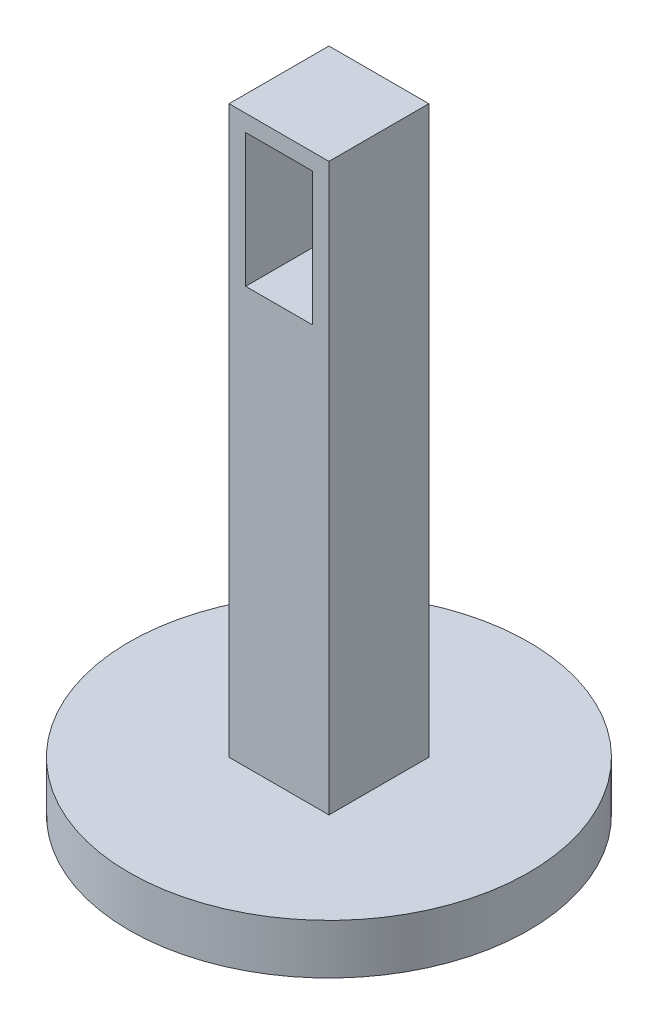
ISO-10303-21;
HEADER;
FILE_DESCRIPTION(('STEP AP214'),'2;1');
FILE_NAME('part.step','',(''),(''),'','','');
FILE_SCHEMA(('AUTOMOTIVE_DESIGN { 1 0 10303 214 1 1 1 1 }'));
ENDSEC;
DATA;
#1=APPLICATION_CONTEXT('core data for automotive mechanical design processes');
#2=APPLICATION_PROTOCOL_DEFINITION('international standard','automotive_design',2000,#1);
#3=PRODUCT_CONTEXT('',#1,'mechanical');
#4=PRODUCT('Part','Part','',(#3));
#5=PRODUCT_RELATED_PRODUCT_CATEGORY('part','',(#4));
#6=PRODUCT_DEFINITION_FORMATION('','',#4);
#7=PRODUCT_DEFINITION_CONTEXT('part definition',#1,'design');
#8=PRODUCT_DEFINITION('design','',#6,#7);
#9=PRODUCT_DEFINITION_SHAPE('','',#8);
#10=(LENGTH_UNIT() NAMED_UNIT(*) SI_UNIT(.MILLI.,.METRE.));
#11=(NAMED_UNIT(*) PLANE_ANGLE_UNIT() SI_UNIT($,.RADIAN.));
#12=(NAMED_UNIT(*) SI_UNIT($,.STERADIAN.) SOLID_ANGLE_UNIT());
#13=UNCERTAINTY_MEASURE_WITH_UNIT(LENGTH_MEASURE(1.E-05),#10,'distance_accuracy_value','');
#14=(GEOMETRIC_REPRESENTATION_CONTEXT(3) GLOBAL_UNCERTAINTY_ASSIGNED_CONTEXT((#13)) GLOBAL_UNIT_ASSIGNED_CONTEXT((#10,
#11,#12)) REPRESENTATION_CONTEXT('',''));
#15=CARTESIAN_POINT('',(0.,0.,0.));
#16=DIRECTION('',(0.,0.,1.));
#17=DIRECTION('',(1.,0.,0.));
#18=AXIS2_PLACEMENT_3D('',#15,#16,#17);
#19=CARTESIAN_POINT('',(0.,15.,0.));
#20=DIRECTION('',(0.,-1.,0.));
#21=DIRECTION('',(0.,0.,-1.));
#22=AXIS2_PLACEMENT_3D('',#19,#20,#21);
#23=CYLINDRICAL_SURFACE('',#22,60.);
#24=CARTESIAN_POINT('',(0.,15.,0.));
#25=DIRECTION('',(0.,1.,0.));
#26=DIRECTION('',(0.,0.,1.));
#27=AXIS2_PLACEMENT_3D('',#24,#25,#26);
#28=CIRCLE('',#27,60.);
#29=CARTESIAN_POINT('',(0.,15.,60.));
#30=VERTEX_POINT('',#29);
#31=EDGE_CURVE('E11',#30,#30,#28,.T.);
#32=ORIENTED_EDGE('',*,*,#31,.F.);
#33=EDGE_LOOP('',(#32));
#34=FACE_BOUND('',#33,.T.);
#35=CARTESIAN_POINT('',(0.,0.,0.));
#36=DIRECTION('',(0.,1.,0.));
#37=DIRECTION('',(0.,0.,1.));
#38=AXIS2_PLACEMENT_3D('',#35,#36,#37);
#39=CIRCLE('',#38,60.);
#40=CARTESIAN_POINT('',(0.,0.,60.));
#41=VERTEX_POINT('',#40);
#42=EDGE_CURVE('E42',#41,#41,#39,.T.);
#43=ORIENTED_EDGE('',*,*,#42,.T.);
#44=EDGE_LOOP('',(#43));
#45=FACE_BOUND('',#44,.T.);
#46=ADVANCED_FACE('F39',(#34,#45),#23,.T.);
#47=CARTESIAN_POINT('',(0.,15.,0.));
#48=DIRECTION('',(0.,1.,0.));
#49=DIRECTION('',(0.,0.,1.));
#50=AXIS2_PLACEMENT_3D('',#47,#48,#49);
#51=PLANE('',#50);
#52=DIRECTION('',(0.,0.,-1.));
#53=VECTOR('',#52,1.);
#54=CARTESIAN_POINT('',(15.,15.,-15.));
#55=LINE('',#54,#53);
#56=CARTESIAN_POINT('',(15.,15.,15.));
#57=VERTEX_POINT('',#56);
#58=CARTESIAN_POINT('',(15.,15.,-15.));
#59=VERTEX_POINT('',#58);
#60=EDGE_CURVE('E62',#57,#59,#55,.T.);
#61=ORIENTED_EDGE('',*,*,#60,.F.);
#62=DIRECTION('',(1.,0.,0.));
#63=VECTOR('',#62,1.);
#64=CARTESIAN_POINT('',(-15.,15.,15.));
#65=LINE('',#64,#63);
#66=CARTESIAN_POINT('',(-15.,15.,15.));
#67=VERTEX_POINT('',#66);
#68=EDGE_CURVE('E158',#67,#57,#65,.T.);
#69=ORIENTED_EDGE('',*,*,#68,.F.);
#70=DIRECTION('',(0.,0.,1.));
#71=VECTOR('',#70,1.);
#72=CARTESIAN_POINT('',(-15.,15.,-15.));
#73=LINE('',#72,#71);
#74=CARTESIAN_POINT('',(-15.,15.,-15.));
#75=VERTEX_POINT('',#74);
#76=EDGE_CURVE('E174',#75,#67,#73,.T.);
#77=ORIENTED_EDGE('',*,*,#76,.F.);
#78=DIRECTION('',(-1.,0.,0.));
#79=VECTOR('',#78,1.);
#80=CARTESIAN_POINT('',(-15.,15.,-15.));
#81=LINE('',#80,#79);
#82=EDGE_CURVE('E170',#59,#75,#81,.T.);
#83=ORIENTED_EDGE('',*,*,#82,.F.);
#84=EDGE_LOOP('',(#61,#69,#77,#83));
#85=FACE_BOUND('',#84,.T.);
#86=ORIENTED_EDGE('',*,*,#31,.T.);
#87=EDGE_LOOP('',(#86));
#88=FACE_BOUND('',#87,.T.);
#89=ADVANCED_FACE('F204',(#85,#88),#51,.T.);
#90=CARTESIAN_POINT('',(0.,0.,0.));
#91=DIRECTION('',(0.,1.,0.));
#92=DIRECTION('',(0.,0.,1.));
#93=AXIS2_PLACEMENT_3D('',#90,#91,#92);
#94=PLANE('',#93);
#95=ORIENTED_EDGE('',*,*,#42,.F.);
#96=EDGE_LOOP('',(#95));
#97=FACE_BOUND('',#96,.T.);
#98=ADVANCED_FACE('F201',(#97),#94,.F.);
#99=CARTESIAN_POINT('',(15.,185.,-15.));
#100=DIRECTION('',(-1.,0.,0.));
#101=DIRECTION('',(0.,0.,1.));
#102=AXIS2_PLACEMENT_3D('',#99,#100,#101);
#103=PLANE('',#102);
#104=ORIENTED_EDGE('',*,*,#60,.T.);
#105=DIRECTION('',(0.,-1.,0.));
#106=VECTOR('',#105,1.);
#107=CARTESIAN_POINT('',(15.,185.,-15.));
#108=LINE('',#107,#106);
#109=CARTESIAN_POINT('',(15.,185.,-15.));
#110=VERTEX_POINT('',#109);
#111=EDGE_CURVE('E191',#110,#59,#108,.T.);
#112=ORIENTED_EDGE('',*,*,#111,.F.);
#113=DIRECTION('',(0.,0.,-1.));
#114=VECTOR('',#113,1.);
#115=CARTESIAN_POINT('',(15.,185.,-15.));
#116=LINE('',#115,#114);
#117=CARTESIAN_POINT('',(15.,185.,15.));
#118=VERTEX_POINT('',#117);
#119=EDGE_CURVE('E153',#118,#110,#116,.T.);
#120=ORIENTED_EDGE('',*,*,#119,.F.);
#121=DIRECTION('',(0.,-1.,0.));
#122=VECTOR('',#121,1.);
#123=CARTESIAN_POINT('',(15.,185.,15.));
#124=LINE('',#123,#122);
#125=EDGE_CURVE('E167',#118,#57,#124,.T.);
#126=ORIENTED_EDGE('',*,*,#125,.T.);
#127=EDGE_LOOP('',(#104,#112,#120,#126));
#128=FACE_BOUND('',#127,.T.);
#129=ADVANCED_FACE('F203',(#128),#103,.F.);
#130=CARTESIAN_POINT('',(-15.,185.,-15.));
#131=DIRECTION('',(0.,0.,1.));
#132=DIRECTION('',(1.,0.,0.));
#133=AXIS2_PLACEMENT_3D('',#130,#131,#132);
#134=PLANE('',#133);
#135=ORIENTED_EDGE('',*,*,#82,.T.);
#136=DIRECTION('',(0.,-1.,0.));
#137=VECTOR('',#136,1.);
#138=CARTESIAN_POINT('',(-15.,185.,-15.));
#139=LINE('',#138,#137);
#140=CARTESIAN_POINT('',(-15.,185.,-15.));
#141=VERTEX_POINT('',#140);
#142=EDGE_CURVE('E187',#141,#75,#139,.T.);
#143=ORIENTED_EDGE('',*,*,#142,.F.);
#144=DIRECTION('',(-1.,0.,0.));
#145=VECTOR('',#144,1.);
#146=CARTESIAN_POINT('',(-15.,185.,-15.));
#147=LINE('',#146,#145);
#148=EDGE_CURVE('E157',#110,#141,#147,.T.);
#149=ORIENTED_EDGE('',*,*,#148,.F.);
#150=ORIENTED_EDGE('',*,*,#111,.T.);
#151=EDGE_LOOP('',(#135,#143,#149,#150));
#152=FACE_BOUND('',#151,.T.);
#153=ADVANCED_FACE('F209',(#152),#134,.F.);
#154=CARTESIAN_POINT('',(-15.,185.,-15.));
#155=DIRECTION('',(1.,0.,0.));
#156=DIRECTION('',(0.,0.,-1.));
#157=AXIS2_PLACEMENT_3D('',#154,#155,#156);
#158=PLANE('',#157);
#159=ORIENTED_EDGE('',*,*,#76,.T.);
#160=DIRECTION('',(0.,-1.,0.));
#161=VECTOR('',#160,1.);
#162=CARTESIAN_POINT('',(-15.,185.,15.));
#163=LINE('',#162,#161);
#164=CARTESIAN_POINT('',(-15.,185.,15.));
#165=VERTEX_POINT('',#164);
#166=EDGE_CURVE('E183',#165,#67,#163,.T.);
#167=ORIENTED_EDGE('',*,*,#166,.F.);
#168=DIRECTION('',(0.,0.,1.));
#169=VECTOR('',#168,1.);
#170=CARTESIAN_POINT('',(-15.,185.,-15.));
#171=LINE('',#170,#169);
#172=EDGE_CURVE('E161',#141,#165,#171,.T.);
#173=ORIENTED_EDGE('',*,*,#172,.F.);
#174=ORIENTED_EDGE('',*,*,#142,.T.);
#175=EDGE_LOOP('',(#159,#167,#173,#174));
#176=FACE_BOUND('',#175,.T.);
#177=ADVANCED_FACE('F240',(#176),#158,.F.);
#178=CARTESIAN_POINT('',(-15.,185.,15.));
#179=DIRECTION('',(0.,0.,-1.));
#180=DIRECTION('',(-1.,0.,0.));
#181=AXIS2_PLACEMENT_3D('',#178,#179,#180);
#182=PLANE('',#181);
#183=DIRECTION('',(1.,0.,0.));
#184=VECTOR('',#183,1.);
#185=CARTESIAN_POINT('',(-10.,140.,15.));
#186=LINE('',#185,#184);
#187=CARTESIAN_POINT('',(-10.,140.,15.));
#188=VERTEX_POINT('',#187);
#189=CARTESIAN_POINT('',(10.,140.,15.));
#190=VERTEX_POINT('',#189);
#191=EDGE_CURVE('E139',#188,#190,#186,.T.);
#192=ORIENTED_EDGE('',*,*,#191,.F.);
#193=DIRECTION('',(0.,-1.,0.));
#194=VECTOR('',#193,1.);
#195=CARTESIAN_POINT('',(-10.,180.,15.));
#196=LINE('',#195,#194);
#197=CARTESIAN_POINT('',(-10.,180.,15.));
#198=VERTEX_POINT('',#197);
#199=EDGE_CURVE('E54',#198,#188,#196,.T.);
#200=ORIENTED_EDGE('',*,*,#199,.F.);
#201=DIRECTION('',(1.,0.,0.));
#202=VECTOR('',#201,1.);
#203=CARTESIAN_POINT('',(-10.,180.,15.));
#204=LINE('',#203,#202);
#205=CARTESIAN_POINT('',(10.,180.,15.));
#206=VERTEX_POINT('',#205);
#207=EDGE_CURVE('E126',#198,#206,#204,.T.);
#208=ORIENTED_EDGE('',*,*,#207,.T.);
#209=DIRECTION('',(0.,-1.,0.));
#210=VECTOR('',#209,1.);
#211=CARTESIAN_POINT('',(10.,180.,15.));
#212=LINE('',#211,#210);
#213=EDGE_CURVE('E130',#206,#190,#212,.T.);
#214=ORIENTED_EDGE('',*,*,#213,.T.);
#215=EDGE_LOOP('',(#192,#200,#208,#214));
#216=FACE_BOUND('',#215,.T.);
#217=ORIENTED_EDGE('',*,*,#68,.T.);
#218=ORIENTED_EDGE('',*,*,#125,.F.);
#219=DIRECTION('',(1.,0.,0.));
#220=VECTOR('',#219,1.);
#221=CARTESIAN_POINT('',(-15.,185.,15.));
#222=LINE('',#221,#220);
#223=EDGE_CURVE('E164',#165,#118,#222,.T.);
#224=ORIENTED_EDGE('',*,*,#223,.F.);
#225=ORIENTED_EDGE('',*,*,#166,.T.);
#226=EDGE_LOOP('',(#217,#218,#224,#225));
#227=FACE_BOUND('',#226,.T.);
#228=ADVANCED_FACE('F249',(#216,#227),#182,.F.);
#229=CARTESIAN_POINT('',(0.,185.,0.));
#230=DIRECTION('',(0.,1.,0.));
#231=DIRECTION('',(0.,0.,1.));
#232=AXIS2_PLACEMENT_3D('',#229,#230,#231);
#233=PLANE('',#232);
#234=ORIENTED_EDGE('',*,*,#119,.T.);
#235=ORIENTED_EDGE('',*,*,#148,.T.);
#236=ORIENTED_EDGE('',*,*,#172,.T.);
#237=ORIENTED_EDGE('',*,*,#223,.T.);
#238=EDGE_LOOP('',(#234,#235,#236,#237));
#239=FACE_BOUND('',#238,.T.);
#240=ADVANCED_FACE('F257',(#239),#233,.T.);
#241=CARTESIAN_POINT('',(-10.,180.,-5.));
#242=DIRECTION('',(-1.,0.,0.));
#243=DIRECTION('',(0.,0.,1.));
#244=AXIS2_PLACEMENT_3D('',#241,#242,#243);
#245=PLANE('',#244);
#246=ORIENTED_EDGE('',*,*,#199,.T.);
#247=DIRECTION('',(0.,0.,1.));
#248=VECTOR('',#247,1.);
#249=CARTESIAN_POINT('',(-10.,140.,-5.));
#250=LINE('',#249,#248);
#251=CARTESIAN_POINT('',(-10.,140.,-5.));
#252=VERTEX_POINT('',#251);
#253=EDGE_CURVE('E102',#252,#188,#250,.T.);
#254=ORIENTED_EDGE('',*,*,#253,.F.);
#255=DIRECTION('',(0.,-1.,0.));
#256=VECTOR('',#255,1.);
#257=CARTESIAN_POINT('',(-10.,180.,-5.));
#258=LINE('',#257,#256);
#259=CARTESIAN_POINT('',(-10.,180.,-5.));
#260=VERTEX_POINT('',#259);
#261=EDGE_CURVE('E106',#260,#252,#258,.T.);
#262=ORIENTED_EDGE('',*,*,#261,.F.);
#263=DIRECTION('',(0.,0.,1.));
#264=VECTOR('',#263,1.);
#265=CARTESIAN_POINT('',(-10.,180.,-5.));
#266=LINE('',#265,#264);
#267=EDGE_CURVE('E145',#260,#198,#266,.T.);
#268=ORIENTED_EDGE('',*,*,#267,.T.);
#269=EDGE_LOOP('',(#246,#254,#262,#268));
#270=FACE_BOUND('',#269,.T.);
#271=ADVANCED_FACE('F104',(#270),#245,.F.);
#272=CARTESIAN_POINT('',(-10.,180.,-5.));
#273=DIRECTION('',(0.,-1.,0.));
#274=DIRECTION('',(0.,0.,-1.));
#275=AXIS2_PLACEMENT_3D('',#272,#273,#274);
#276=PLANE('',#275);
#277=ORIENTED_EDGE('',*,*,#207,.F.);
#278=ORIENTED_EDGE('',*,*,#267,.F.);
#279=DIRECTION('',(1.,0.,0.));
#280=VECTOR('',#279,1.);
#281=CARTESIAN_POINT('',(-10.,180.,-5.));
#282=LINE('',#281,#280);
#283=CARTESIAN_POINT('',(10.,180.,-5.));
#284=VERTEX_POINT('',#283);
#285=EDGE_CURVE('E112',#260,#284,#282,.T.);
#286=ORIENTED_EDGE('',*,*,#285,.T.);
#287=DIRECTION('',(0.,0.,1.));
#288=VECTOR('',#287,1.);
#289=CARTESIAN_POINT('',(10.,180.,-5.));
#290=LINE('',#289,#288);
#291=EDGE_CURVE('E148',#284,#206,#290,.T.);
#292=ORIENTED_EDGE('',*,*,#291,.T.);
#293=EDGE_LOOP('',(#277,#278,#286,#292));
#294=FACE_BOUND('',#293,.T.);
#295=ADVANCED_FACE('F278',(#294),#276,.T.);
#296=CARTESIAN_POINT('',(10.,180.,-5.));
#297=DIRECTION('',(-1.,0.,0.));
#298=DIRECTION('',(0.,-1.,0.));
#299=AXIS2_PLACEMENT_3D('',#296,#297,#298);
#300=PLANE('',#299);
#301=ORIENTED_EDGE('',*,*,#213,.F.);
#302=ORIENTED_EDGE('',*,*,#291,.F.);
#303=DIRECTION('',(0.,-1.,0.));
#304=VECTOR('',#303,1.);
#305=CARTESIAN_POINT('',(10.,180.,-5.));
#306=LINE('',#305,#304);
#307=CARTESIAN_POINT('',(10.,140.,-5.));
#308=VERTEX_POINT('',#307);
#309=EDGE_CURVE('E121',#284,#308,#306,.T.);
#310=ORIENTED_EDGE('',*,*,#309,.T.);
#311=DIRECTION('',(0.,0.,1.));
#312=VECTOR('',#311,1.);
#313=CARTESIAN_POINT('',(10.,140.,-5.));
#314=LINE('',#313,#312);
#315=EDGE_CURVE('E111',#308,#190,#314,.T.);
#316=ORIENTED_EDGE('',*,*,#315,.T.);
#317=EDGE_LOOP('',(#301,#302,#310,#316));
#318=FACE_BOUND('',#317,.T.);
#319=ADVANCED_FACE('F287',(#318),#300,.T.);
#320=CARTESIAN_POINT('',(-10.,140.,-5.));
#321=DIRECTION('',(0.,-1.,0.));
#322=DIRECTION('',(0.,0.,-1.));
#323=AXIS2_PLACEMENT_3D('',#320,#321,#322);
#324=PLANE('',#323);
#325=ORIENTED_EDGE('',*,*,#191,.T.);
#326=ORIENTED_EDGE('',*,*,#315,.F.);
#327=DIRECTION('',(1.,0.,0.));
#328=VECTOR('',#327,1.);
#329=CARTESIAN_POINT('',(-10.,140.,-5.));
#330=LINE('',#329,#328);
#331=EDGE_CURVE('E116',#252,#308,#330,.T.);
#332=ORIENTED_EDGE('',*,*,#331,.F.);
#333=ORIENTED_EDGE('',*,*,#253,.T.);
#334=EDGE_LOOP('',(#325,#326,#332,#333));
#335=FACE_BOUND('',#334,.T.);
#336=ADVANCED_FACE('F117',(#335),#324,.F.);
#337=CARTESIAN_POINT('',(0.,0.,-5.));
#338=DIRECTION('',(0.,0.,1.));
#339=DIRECTION('',(1.,0.,0.));
#340=AXIS2_PLACEMENT_3D('',#337,#338,#339);
#341=PLANE('',#340);
#342=ORIENTED_EDGE('',*,*,#261,.T.);
#343=ORIENTED_EDGE('',*,*,#331,.T.);
#344=ORIENTED_EDGE('',*,*,#309,.F.);
#345=ORIENTED_EDGE('',*,*,#285,.F.);
#346=EDGE_LOOP('',(#342,#343,#344,#345));
#347=FACE_BOUND('',#346,.T.);
#348=ADVANCED_FACE('F124',(#347),#341,.T.);
#349=CLOSED_SHELL('',(#46,#89,#98,#129,#153,#177,#228,#240,#271,#295,#319,#336,#348));
#350=MANIFOLD_SOLID_BREP('B2',#349);
#351=ADVANCED_BREP_SHAPE_REPRESENTATION('',(#18,#350),#14);
#352=SHAPE_DEFINITION_REPRESENTATION(#9,#351);
ENDSEC;
END-ISO-10303-21;
